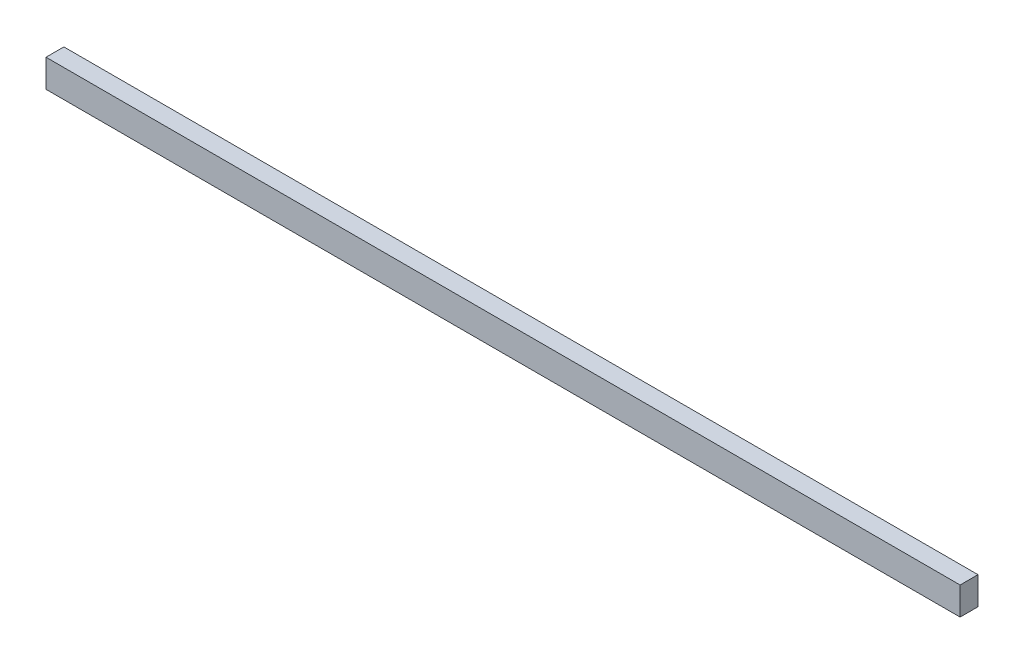
ISO-10303-21;
HEADER;
FILE_DESCRIPTION(('STEP AP214'),'2;1');
FILE_NAME('part.step','',(''),(''),'','','');
FILE_SCHEMA(('AUTOMOTIVE_DESIGN { 1 0 10303 214 1 1 1 1 }'));
ENDSEC;
DATA;
#1=APPLICATION_CONTEXT('core data for automotive mechanical design processes');
#2=APPLICATION_PROTOCOL_DEFINITION('international standard','automotive_design',2000,#1);
#3=PRODUCT_CONTEXT('',#1,'mechanical');
#4=PRODUCT('Part','Part','',(#3));
#5=PRODUCT_RELATED_PRODUCT_CATEGORY('part','',(#4));
#6=PRODUCT_DEFINITION_FORMATION('','',#4);
#7=PRODUCT_DEFINITION_CONTEXT('part definition',#1,'design');
#8=PRODUCT_DEFINITION('design','',#6,#7);
#9=PRODUCT_DEFINITION_SHAPE('','',#8);
#10=(LENGTH_UNIT() NAMED_UNIT(*) SI_UNIT(.MILLI.,.METRE.));
#11=(NAMED_UNIT(*) PLANE_ANGLE_UNIT() SI_UNIT($,.RADIAN.));
#12=(NAMED_UNIT(*) SI_UNIT($,.STERADIAN.) SOLID_ANGLE_UNIT());
#13=UNCERTAINTY_MEASURE_WITH_UNIT(LENGTH_MEASURE(1.E-05),#10,'distance_accuracy_value','');
#14=(GEOMETRIC_REPRESENTATION_CONTEXT(3) GLOBAL_UNCERTAINTY_ASSIGNED_CONTEXT((#13)) GLOBAL_UNIT_ASSIGNED_CONTEXT((#10,
#11,#12)) REPRESENTATION_CONTEXT('',''));
#15=CARTESIAN_POINT('',(0.,0.,0.));
#16=DIRECTION('',(0.,0.,1.));
#17=DIRECTION('',(1.,0.,0.));
#18=AXIS2_PLACEMENT_3D('',#15,#16,#17);
#19=CARTESIAN_POINT('',(2300.,0.,0.));
#20=DIRECTION('',(0.,0.,-1.));
#21=DIRECTION('',(0.,1.,0.));
#22=AXIS2_PLACEMENT_3D('',#19,#20,#21);
#23=PLANE('',#22);
#24=DIRECTION('',(0.,-1.,0.));
#25=VECTOR('',#24,1.);
#26=CARTESIAN_POINT('',(0.,0.,0.));
#27=LINE('',#26,#25);
#28=CARTESIAN_POINT('',(0.,0.,0.));
#29=VERTEX_POINT('',#28);
#30=CARTESIAN_POINT('',(0.,-70.,0.));
#31=VERTEX_POINT('',#30);
#32=EDGE_CURVE('E96',#29,#31,#27,.T.);
#33=ORIENTED_EDGE('',*,*,#32,.T.);
#34=DIRECTION('',(-1.,0.,0.));
#35=VECTOR('',#34,1.);
#36=CARTESIAN_POINT('',(2300.,-70.,0.));
#37=LINE('',#36,#35);
#38=CARTESIAN_POINT('',(2300.,-70.,0.));
#39=VERTEX_POINT('',#38);
#40=EDGE_CURVE('E11',#39,#31,#37,.T.);
#41=ORIENTED_EDGE('',*,*,#40,.F.);
#42=DIRECTION('',(0.,-1.,0.));
#43=VECTOR('',#42,1.);
#44=CARTESIAN_POINT('',(2300.,0.,0.));
#45=LINE('',#44,#43);
#46=CARTESIAN_POINT('',(2300.,0.,0.));
#47=VERTEX_POINT('',#46);
#48=EDGE_CURVE('E84',#47,#39,#45,.T.);
#49=ORIENTED_EDGE('',*,*,#48,.F.);
#50=DIRECTION('',(-1.,0.,0.));
#51=VECTOR('',#50,1.);
#52=CARTESIAN_POINT('',(2300.,0.,0.));
#53=LINE('',#52,#51);
#54=EDGE_CURVE('E92',#47,#29,#53,.T.);
#55=ORIENTED_EDGE('',*,*,#54,.T.);
#56=EDGE_LOOP('',(#33,#41,#49,#55));
#57=FACE_BOUND('',#56,.T.);
#58=ADVANCED_FACE('F33',(#57),#23,.F.);
#59=CARTESIAN_POINT('',(2300.,-70.,0.));
#60=DIRECTION('',(0.,1.,0.));
#61=DIRECTION('',(0.,0.,1.));
#62=AXIS2_PLACEMENT_3D('',#59,#60,#61);
#63=PLANE('',#62);
#64=DIRECTION('',(0.,0.,-1.));
#65=VECTOR('',#64,1.);
#66=CARTESIAN_POINT('',(0.,-70.,0.));
#67=LINE('',#66,#65);
#68=CARTESIAN_POINT('',(0.,-70.,-45.));
#69=VERTEX_POINT('',#68);
#70=EDGE_CURVE('E88',#31,#69,#67,.T.);
#71=ORIENTED_EDGE('',*,*,#70,.T.);
#72=DIRECTION('',(-1.,0.,0.));
#73=VECTOR('',#72,1.);
#74=CARTESIAN_POINT('',(2300.,-70.,-45.));
#75=LINE('',#74,#73);
#76=CARTESIAN_POINT('',(2300.,-70.,-45.));
#77=VERTEX_POINT('',#76);
#78=EDGE_CURVE('E41',#77,#69,#75,.T.);
#79=ORIENTED_EDGE('',*,*,#78,.F.);
#80=DIRECTION('',(0.,0.,-1.));
#81=VECTOR('',#80,1.);
#82=CARTESIAN_POINT('',(2300.,-70.,0.));
#83=LINE('',#82,#81);
#84=EDGE_CURVE('E79',#39,#77,#83,.T.);
#85=ORIENTED_EDGE('',*,*,#84,.F.);
#86=ORIENTED_EDGE('',*,*,#40,.T.);
#87=EDGE_LOOP('',(#71,#79,#85,#86));
#88=FACE_BOUND('',#87,.T.);
#89=ADVANCED_FACE('F87',(#88),#63,.F.);
#90=CARTESIAN_POINT('',(2300.,0.,-45.));
#91=DIRECTION('',(0.,0.,1.));
#92=DIRECTION('',(0.,-1.,0.));
#93=AXIS2_PLACEMENT_3D('',#90,#91,#92);
#94=PLANE('',#93);
#95=DIRECTION('',(0.,1.,0.));
#96=VECTOR('',#95,1.);
#97=CARTESIAN_POINT('',(0.,0.,-45.));
#98=LINE('',#97,#96);
#99=CARTESIAN_POINT('',(0.,0.,-45.));
#100=VERTEX_POINT('',#99);
#101=EDGE_CURVE('E66',#69,#100,#98,.T.);
#102=ORIENTED_EDGE('',*,*,#101,.T.);
#103=DIRECTION('',(-1.,0.,0.));
#104=VECTOR('',#103,1.);
#105=CARTESIAN_POINT('',(2300.,0.,-45.));
#106=LINE('',#105,#104);
#107=CARTESIAN_POINT('',(2300.,0.,-45.));
#108=VERTEX_POINT('',#107);
#109=EDGE_CURVE('E89',#108,#100,#106,.T.);
#110=ORIENTED_EDGE('',*,*,#109,.F.);
#111=DIRECTION('',(0.,1.,0.));
#112=VECTOR('',#111,1.);
#113=CARTESIAN_POINT('',(2300.,0.,-45.));
#114=LINE('',#113,#112);
#115=EDGE_CURVE('E82',#77,#108,#114,.T.);
#116=ORIENTED_EDGE('',*,*,#115,.F.);
#117=ORIENTED_EDGE('',*,*,#78,.T.);
#118=EDGE_LOOP('',(#102,#110,#116,#117));
#119=FACE_BOUND('',#118,.T.);
#120=ADVANCED_FACE('F90',(#119),#94,.F.);
#121=CARTESIAN_POINT('',(2300.,0.,0.));
#122=DIRECTION('',(0.,-1.,0.));
#123=DIRECTION('',(0.,0.,-1.));
#124=AXIS2_PLACEMENT_3D('',#121,#122,#123);
#125=PLANE('',#124);
#126=DIRECTION('',(0.,0.,1.));
#127=VECTOR('',#126,1.);
#128=CARTESIAN_POINT('',(0.,0.,0.));
#129=LINE('',#128,#127);
#130=EDGE_CURVE('E72',#100,#29,#129,.T.);
#131=ORIENTED_EDGE('',*,*,#130,.T.);
#132=ORIENTED_EDGE('',*,*,#54,.F.);
#133=DIRECTION('',(0.,0.,1.));
#134=VECTOR('',#133,1.);
#135=CARTESIAN_POINT('',(2300.,0.,0.));
#136=LINE('',#135,#134);
#137=EDGE_CURVE('E49',#108,#47,#136,.T.);
#138=ORIENTED_EDGE('',*,*,#137,.F.);
#139=ORIENTED_EDGE('',*,*,#109,.T.);
#140=EDGE_LOOP('',(#131,#132,#138,#139));
#141=FACE_BOUND('',#140,.T.);
#142=ADVANCED_FACE('F103',(#141),#125,.F.);
#143=CARTESIAN_POINT('',(2300.,0.,0.));
#144=DIRECTION('',(1.,0.,0.));
#145=DIRECTION('',(0.,0.,-1.));
#146=AXIS2_PLACEMENT_3D('',#143,#144,#145);
#147=PLANE('',#146);
#148=ORIENTED_EDGE('',*,*,#48,.T.);
#149=ORIENTED_EDGE('',*,*,#84,.T.);
#150=ORIENTED_EDGE('',*,*,#115,.T.);
#151=ORIENTED_EDGE('',*,*,#137,.T.);
#152=EDGE_LOOP('',(#148,#149,#150,#151));
#153=FACE_BOUND('',#152,.T.);
#154=ADVANCED_FACE('F80',(#153),#147,.T.);
#155=CARTESIAN_POINT('',(0.,0.,0.));
#156=DIRECTION('',(1.,0.,0.));
#157=DIRECTION('',(0.,0.,-1.));
#158=AXIS2_PLACEMENT_3D('',#155,#156,#157);
#159=PLANE('',#158);
#160=ORIENTED_EDGE('',*,*,#32,.F.);
#161=ORIENTED_EDGE('',*,*,#130,.F.);
#162=ORIENTED_EDGE('',*,*,#101,.F.);
#163=ORIENTED_EDGE('',*,*,#70,.F.);
#164=EDGE_LOOP('',(#160,#161,#162,#163));
#165=FACE_BOUND('',#164,.T.);
#166=ADVANCED_FACE('F106',(#165),#159,.F.);
#167=CLOSED_SHELL('',(#58,#89,#120,#142,#154,#166));
#168=MANIFOLD_SOLID_BREP('B2',#167);
#169=ADVANCED_BREP_SHAPE_REPRESENTATION('',(#18,#168),#14);
#170=SHAPE_DEFINITION_REPRESENTATION(#9,#169);
ENDSEC;
END-ISO-10303-21;
